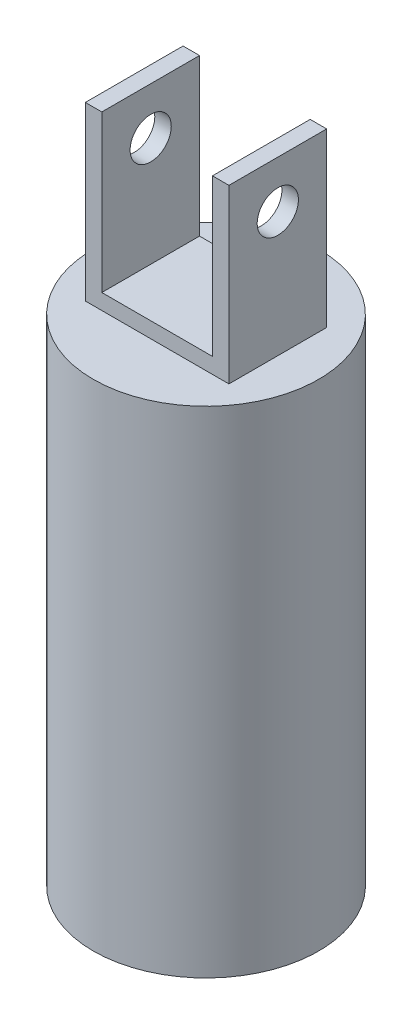
ISO-10303-21;
HEADER;
FILE_DESCRIPTION(('STEP AP214'),'2;1');
FILE_NAME('part.step','',(''),(''),'','','');
FILE_SCHEMA(('AUTOMOTIVE_DESIGN { 1 0 10303 214 1 1 1 1 }'));
ENDSEC;
DATA;
#1=APPLICATION_CONTEXT('core data for automotive mechanical design processes');
#2=APPLICATION_PROTOCOL_DEFINITION('international standard','automotive_design',2000,#1);
#3=PRODUCT_CONTEXT('',#1,'mechanical');
#4=PRODUCT('Part','Part','',(#3));
#5=PRODUCT_RELATED_PRODUCT_CATEGORY('part','',(#4));
#6=PRODUCT_DEFINITION_FORMATION('','',#4);
#7=PRODUCT_DEFINITION_CONTEXT('part definition',#1,'design');
#8=PRODUCT_DEFINITION('design','',#6,#7);
#9=PRODUCT_DEFINITION_SHAPE('','',#8);
#10=(LENGTH_UNIT() NAMED_UNIT(*) SI_UNIT(.MILLI.,.METRE.));
#11=(NAMED_UNIT(*) PLANE_ANGLE_UNIT() SI_UNIT($,.RADIAN.));
#12=(NAMED_UNIT(*) SI_UNIT($,.STERADIAN.) SOLID_ANGLE_UNIT());
#13=UNCERTAINTY_MEASURE_WITH_UNIT(LENGTH_MEASURE(1.E-05),#10,'distance_accuracy_value','');
#14=(GEOMETRIC_REPRESENTATION_CONTEXT(3) GLOBAL_UNCERTAINTY_ASSIGNED_CONTEXT((#13)) GLOBAL_UNIT_ASSIGNED_CONTEXT((#10,
#11,#12)) REPRESENTATION_CONTEXT('',''));
#15=CARTESIAN_POINT('',(0.,0.,0.));
#16=DIRECTION('',(0.,0.,1.));
#17=DIRECTION('',(1.,0.,0.));
#18=AXIS2_PLACEMENT_3D('',#15,#16,#17);
#19=CARTESIAN_POINT('',(0.,50.3809,28.6258));
#20=DIRECTION('',(0.,1.,0.));
#21=DIRECTION('',(0.,0.,1.));
#22=AXIS2_PLACEMENT_3D('',#19,#20,#21);
#23=PLANE('',#22);
#24=DIRECTION('',(1.,0.,0.));
#25=VECTOR('',#24,1.);
#26=CARTESIAN_POINT('',(0.,50.3809,0.));
#27=LINE('',#26,#25);
#28=CARTESIAN_POINT('',(37.2364,50.3809,0.));
#29=VERTEX_POINT('',#28);
#30=CARTESIAN_POINT('',(42.0624,50.3809,0.));
#31=VERTEX_POINT('',#30);
#32=EDGE_CURVE('E147',#29,#31,#27,.T.);
#33=ORIENTED_EDGE('',*,*,#32,.F.);
#34=DIRECTION('',(0.,0.,-1.));
#35=VECTOR('',#34,1.);
#36=CARTESIAN_POINT('',(37.2364,50.3809,28.6258));
#37=LINE('',#36,#35);
#38=CARTESIAN_POINT('',(37.2364,50.3809,28.6258));
#39=VERTEX_POINT('',#38);
#40=EDGE_CURVE('E12',#39,#29,#37,.T.);
#41=ORIENTED_EDGE('',*,*,#40,.F.);
#42=DIRECTION('',(1.,0.,0.));
#43=VECTOR('',#42,1.);
#44=CARTESIAN_POINT('',(0.,50.3809,28.6258));
#45=LINE('',#44,#43);
#46=CARTESIAN_POINT('',(42.0624,50.3809,28.6258));
#47=VERTEX_POINT('',#46);
#48=EDGE_CURVE('E176',#39,#47,#45,.T.);
#49=ORIENTED_EDGE('',*,*,#48,.T.);
#50=DIRECTION('',(0.,0.,-1.));
#51=VECTOR('',#50,1.);
#52=CARTESIAN_POINT('',(42.0624,50.3809,28.6258));
#53=LINE('',#52,#51);
#54=EDGE_CURVE('E100',#47,#31,#53,.T.);
#55=ORIENTED_EDGE('',*,*,#54,.T.);
#56=EDGE_LOOP('',(#33,#41,#49,#55));
#57=FACE_BOUND('',#56,.T.);
#58=ADVANCED_FACE('F49',(#57),#23,.T.);
#59=CARTESIAN_POINT('',(37.2364,0.,28.6258));
#60=DIRECTION('',(-1.,0.,0.));
#61=DIRECTION('',(0.,0.,1.));
#62=AXIS2_PLACEMENT_3D('',#59,#60,#61);
#63=PLANE('',#62);
#64=CARTESIAN_POINT('',(37.2364,36.576,14.3129));
#65=DIRECTION('',(-1.,0.,0.));
#66=DIRECTION('',(0.,0.,1.));
#67=AXIS2_PLACEMENT_3D('',#64,#65,#66);
#68=CIRCLE('',#67,6.0325);
#69=CARTESIAN_POINT('',(37.2364,36.576,20.3454));
#70=VERTEX_POINT('',#69);
#71=EDGE_CURVE('E230',#70,#70,#68,.T.);
#72=ORIENTED_EDGE('',*,*,#71,.F.);
#73=EDGE_LOOP('',(#72));
#74=FACE_BOUND('',#73,.T.);
#75=DIRECTION('',(0.,1.,0.));
#76=VECTOR('',#75,1.);
#77=CARTESIAN_POINT('',(37.2364,0.,0.));
#78=LINE('',#77,#76);
#79=CARTESIAN_POINT('',(37.2364,4.572,0.));
#80=VERTEX_POINT('',#79);
#81=EDGE_CURVE('E151',#80,#29,#78,.T.);
#82=ORIENTED_EDGE('',*,*,#81,.F.);
#83=DIRECTION('',(0.,0.,-1.));
#84=VECTOR('',#83,1.);
#85=CARTESIAN_POINT('',(37.2364,4.572,28.6258));
#86=LINE('',#85,#84);
#87=CARTESIAN_POINT('',(37.2364,4.572,28.6258));
#88=VERTEX_POINT('',#87);
#89=EDGE_CURVE('E58',#88,#80,#86,.T.);
#90=ORIENTED_EDGE('',*,*,#89,.F.);
#91=DIRECTION('',(0.,1.,0.));
#92=VECTOR('',#91,1.);
#93=CARTESIAN_POINT('',(37.2364,0.,28.6258));
#94=LINE('',#93,#92);
#95=EDGE_CURVE('E208',#88,#39,#94,.T.);
#96=ORIENTED_EDGE('',*,*,#95,.T.);
#97=ORIENTED_EDGE('',*,*,#40,.T.);
#98=EDGE_LOOP('',(#82,#90,#96,#97));
#99=FACE_BOUND('',#98,.T.);
#100=ADVANCED_FACE('F199',(#74,#99),#63,.T.);
#101=CARTESIAN_POINT('',(0.,4.572,28.6258));
#102=DIRECTION('',(0.,1.,0.));
#103=DIRECTION('',(0.,0.,1.));
#104=AXIS2_PLACEMENT_3D('',#101,#102,#103);
#105=PLANE('',#104);
#106=DIRECTION('',(1.,0.,0.));
#107=VECTOR('',#106,1.);
#108=CARTESIAN_POINT('',(0.,4.572,0.));
#109=LINE('',#108,#107);
#110=CARTESIAN_POINT('',(4.826,4.572,0.));
#111=VERTEX_POINT('',#110);
#112=EDGE_CURVE('E156',#111,#80,#109,.T.);
#113=ORIENTED_EDGE('',*,*,#112,.F.);
#114=DIRECTION('',(0.,0.,-1.));
#115=VECTOR('',#114,1.);
#116=CARTESIAN_POINT('',(4.826,4.572,28.6258));
#117=LINE('',#116,#115);
#118=CARTESIAN_POINT('',(4.826,4.572,28.6258));
#119=VERTEX_POINT('',#118);
#120=EDGE_CURVE('E186',#119,#111,#117,.T.);
#121=ORIENTED_EDGE('',*,*,#120,.F.);
#122=DIRECTION('',(1.,0.,0.));
#123=VECTOR('',#122,1.);
#124=CARTESIAN_POINT('',(0.,4.572,28.6258));
#125=LINE('',#124,#123);
#126=EDGE_CURVE('E195',#119,#88,#125,.T.);
#127=ORIENTED_EDGE('',*,*,#126,.T.);
#128=ORIENTED_EDGE('',*,*,#89,.T.);
#129=EDGE_LOOP('',(#113,#121,#127,#128));
#130=FACE_BOUND('',#129,.T.);
#131=ADVANCED_FACE('F193',(#130),#105,.T.);
#132=CARTESIAN_POINT('',(4.826,0.,28.6258));
#133=DIRECTION('',(1.,0.,0.));
#134=DIRECTION('',(0.,0.,-1.));
#135=AXIS2_PLACEMENT_3D('',#132,#133,#134);
#136=PLANE('',#135);
#137=CARTESIAN_POINT('',(4.826,36.576,14.3129));
#138=DIRECTION('',(1.,0.,0.));
#139=DIRECTION('',(0.,0.,-1.));
#140=AXIS2_PLACEMENT_3D('',#137,#138,#139);
#141=CIRCLE('',#140,6.0325);
#142=CARTESIAN_POINT('',(4.826,36.576,8.2804));
#143=VERTEX_POINT('',#142);
#144=EDGE_CURVE('E234',#143,#143,#141,.T.);
#145=ORIENTED_EDGE('',*,*,#144,.F.);
#146=EDGE_LOOP('',(#145));
#147=FACE_BOUND('',#146,.T.);
#148=DIRECTION('',(0.,-1.,0.));
#149=VECTOR('',#148,1.);
#150=CARTESIAN_POINT('',(4.826,0.,0.));
#151=LINE('',#150,#149);
#152=CARTESIAN_POINT('',(4.826,50.3809,0.));
#153=VERTEX_POINT('',#152);
#154=EDGE_CURVE('E160',#153,#111,#151,.T.);
#155=ORIENTED_EDGE('',*,*,#154,.F.);
#156=DIRECTION('',(0.,0.,-1.));
#157=VECTOR('',#156,1.);
#158=CARTESIAN_POINT('',(4.826,50.3809,28.6258));
#159=LINE('',#158,#157);
#160=CARTESIAN_POINT('',(4.826,50.3809,28.6258));
#161=VERTEX_POINT('',#160);
#162=EDGE_CURVE('E183',#161,#153,#159,.T.);
#163=ORIENTED_EDGE('',*,*,#162,.F.);
#164=DIRECTION('',(0.,-1.,0.));
#165=VECTOR('',#164,1.);
#166=CARTESIAN_POINT('',(4.826,0.,28.6258));
#167=LINE('',#166,#165);
#168=EDGE_CURVE('E207',#161,#119,#167,.T.);
#169=ORIENTED_EDGE('',*,*,#168,.T.);
#170=ORIENTED_EDGE('',*,*,#120,.T.);
#171=EDGE_LOOP('',(#155,#163,#169,#170));
#172=FACE_BOUND('',#171,.T.);
#173=ADVANCED_FACE('F205',(#147,#172),#136,.T.);
#174=CARTESIAN_POINT('',(0.,50.3809,28.6258));
#175=DIRECTION('',(0.,1.,0.));
#176=DIRECTION('',(0.,0.,1.));
#177=AXIS2_PLACEMENT_3D('',#174,#175,#176);
#178=PLANE('',#177);
#179=DIRECTION('',(1.,0.,0.));
#180=VECTOR('',#179,1.);
#181=CARTESIAN_POINT('',(0.,50.3809,0.));
#182=LINE('',#181,#180);
#183=CARTESIAN_POINT('',(0.,50.3809,0.));
#184=VERTEX_POINT('',#183);
#185=EDGE_CURVE('E164',#184,#153,#182,.T.);
#186=ORIENTED_EDGE('',*,*,#185,.F.);
#187=DIRECTION('',(0.,0.,-1.));
#188=VECTOR('',#187,1.);
#189=CARTESIAN_POINT('',(0.,50.3809,28.6258));
#190=LINE('',#189,#188);
#191=CARTESIAN_POINT('',(0.,50.3809,28.6258));
#192=VERTEX_POINT('',#191);
#193=EDGE_CURVE('E129',#192,#184,#190,.T.);
#194=ORIENTED_EDGE('',*,*,#193,.F.);
#195=DIRECTION('',(1.,0.,0.));
#196=VECTOR('',#195,1.);
#197=CARTESIAN_POINT('',(0.,50.3809,28.6258));
#198=LINE('',#197,#196);
#199=EDGE_CURVE('E136',#192,#161,#198,.T.);
#200=ORIENTED_EDGE('',*,*,#199,.T.);
#201=ORIENTED_EDGE('',*,*,#162,.T.);
#202=EDGE_LOOP('',(#186,#194,#200,#201));
#203=FACE_BOUND('',#202,.T.);
#204=ADVANCED_FACE('F218',(#203),#178,.T.);
#205=CARTESIAN_POINT('',(0.,0.,28.6258));
#206=DIRECTION('',(-1.,0.,0.));
#207=DIRECTION('',(0.,0.,1.));
#208=AXIS2_PLACEMENT_3D('',#205,#206,#207);
#209=PLANE('',#208);
#210=CARTESIAN_POINT('',(0.,36.576,14.3129));
#211=DIRECTION('',(-1.,0.,0.));
#212=DIRECTION('',(0.,0.,1.));
#213=AXIS2_PLACEMENT_3D('',#210,#211,#212);
#214=CIRCLE('',#213,6.0325);
#215=CARTESIAN_POINT('',(0.,36.576,20.3454));
#216=VERTEX_POINT('',#215);
#217=EDGE_CURVE('E238',#216,#216,#214,.T.);
#218=ORIENTED_EDGE('',*,*,#217,.F.);
#219=EDGE_LOOP('',(#218));
#220=FACE_BOUND('',#219,.T.);
#221=DIRECTION('',(0.,1.,0.));
#222=VECTOR('',#221,1.);
#223=CARTESIAN_POINT('',(0.,0.,0.));
#224=LINE('',#223,#222);
#225=CARTESIAN_POINT('',(0.,0.,0.));
#226=VERTEX_POINT('',#225);
#227=EDGE_CURVE('E124',#226,#184,#224,.T.);
#228=ORIENTED_EDGE('',*,*,#227,.F.);
#229=DIRECTION('',(0.,0.,-1.));
#230=VECTOR('',#229,1.);
#231=CARTESIAN_POINT('',(0.,0.,28.6258));
#232=LINE('',#231,#230);
#233=CARTESIAN_POINT('',(0.,0.,28.6258));
#234=VERTEX_POINT('',#233);
#235=EDGE_CURVE('E119',#234,#226,#232,.T.);
#236=ORIENTED_EDGE('',*,*,#235,.F.);
#237=DIRECTION('',(0.,1.,0.));
#238=VECTOR('',#237,1.);
#239=CARTESIAN_POINT('',(0.,0.,28.6258));
#240=LINE('',#239,#238);
#241=EDGE_CURVE('E122',#234,#192,#240,.T.);
#242=ORIENTED_EDGE('',*,*,#241,.T.);
#243=ORIENTED_EDGE('',*,*,#193,.T.);
#244=EDGE_LOOP('',(#228,#236,#242,#243));
#245=FACE_BOUND('',#244,.T.);
#246=ADVANCED_FACE('F121',(#220,#245),#209,.T.);
#247=CARTESIAN_POINT('',(42.0624,0.,28.6258));
#248=DIRECTION('',(-1.,0.,0.));
#249=DIRECTION('',(0.,0.,1.));
#250=AXIS2_PLACEMENT_3D('',#247,#248,#249);
#251=PLANE('',#250);
#252=CARTESIAN_POINT('',(42.0624,36.576,14.3129));
#253=DIRECTION('',(1.,0.,0.));
#254=DIRECTION('',(0.,0.,-1.));
#255=AXIS2_PLACEMENT_3D('',#252,#253,#254);
#256=CIRCLE('',#255,6.0325);
#257=CARTESIAN_POINT('',(42.0624,36.576,8.2804));
#258=VERTEX_POINT('',#257);
#259=EDGE_CURVE('E242',#258,#258,#256,.T.);
#260=ORIENTED_EDGE('',*,*,#259,.F.);
#261=EDGE_LOOP('',(#260));
#262=FACE_BOUND('',#261,.T.);
#263=DIRECTION('',(0.,1.,0.));
#264=VECTOR('',#263,1.);
#265=CARTESIAN_POINT('',(42.0624,0.,0.));
#266=LINE('',#265,#264);
#267=CARTESIAN_POINT('',(42.0624,0.,0.));
#268=VERTEX_POINT('',#267);
#269=EDGE_CURVE('E173',#268,#31,#266,.T.);
#270=ORIENTED_EDGE('',*,*,#269,.T.);
#271=ORIENTED_EDGE('',*,*,#54,.F.);
#272=DIRECTION('',(0.,1.,0.));
#273=VECTOR('',#272,1.);
#274=CARTESIAN_POINT('',(42.0624,0.,28.6258));
#275=LINE('',#274,#273);
#276=CARTESIAN_POINT('',(42.0624,0.,28.6258));
#277=VERTEX_POINT('',#276);
#278=EDGE_CURVE('E66',#277,#47,#275,.T.);
#279=ORIENTED_EDGE('',*,*,#278,.F.);
#280=DIRECTION('',(0.,0.,-1.));
#281=VECTOR('',#280,1.);
#282=CARTESIAN_POINT('',(42.0624,0.,28.6258));
#283=LINE('',#282,#281);
#284=EDGE_CURVE('E93',#277,#268,#283,.T.);
#285=ORIENTED_EDGE('',*,*,#284,.T.);
#286=EDGE_LOOP('',(#270,#271,#279,#285));
#287=FACE_BOUND('',#286,.T.);
#288=ADVANCED_FACE('F220',(#262,#287),#251,.F.);
#289=CARTESIAN_POINT('',(0.,0.,28.6258));
#290=DIRECTION('',(0.,0.,1.));
#291=DIRECTION('',(1.,0.,0.));
#292=AXIS2_PLACEMENT_3D('',#289,#290,#291);
#293=PLANE('',#292);
#294=ORIENTED_EDGE('',*,*,#48,.F.);
#295=ORIENTED_EDGE('',*,*,#95,.F.);
#296=ORIENTED_EDGE('',*,*,#126,.F.);
#297=ORIENTED_EDGE('',*,*,#168,.F.);
#298=ORIENTED_EDGE('',*,*,#199,.F.);
#299=ORIENTED_EDGE('',*,*,#241,.F.);
#300=DIRECTION('',(1.,0.,0.));
#301=VECTOR('',#300,1.);
#302=CARTESIAN_POINT('',(0.,0.,28.6258));
#303=LINE('',#302,#301);
#304=EDGE_CURVE('E133',#234,#277,#303,.T.);
#305=ORIENTED_EDGE('',*,*,#304,.T.);
#306=ORIENTED_EDGE('',*,*,#278,.T.);
#307=EDGE_LOOP('',(#294,#295,#296,#297,#298,#299,#305,#306));
#308=FACE_BOUND('',#307,.T.);
#309=ADVANCED_FACE('F132',(#308),#293,.T.);
#310=CARTESIAN_POINT('',(0.,0.,0.));
#311=DIRECTION('',(0.,0.,1.));
#312=DIRECTION('',(1.,0.,0.));
#313=AXIS2_PLACEMENT_3D('',#310,#311,#312);
#314=PLANE('',#313);
#315=ORIENTED_EDGE('',*,*,#32,.T.);
#316=ORIENTED_EDGE('',*,*,#269,.F.);
#317=DIRECTION('',(1.,0.,0.));
#318=VECTOR('',#317,1.);
#319=CARTESIAN_POINT('',(0.,0.,0.));
#320=LINE('',#319,#318);
#321=EDGE_CURVE('E170',#226,#268,#320,.T.);
#322=ORIENTED_EDGE('',*,*,#321,.F.);
#323=ORIENTED_EDGE('',*,*,#227,.T.);
#324=ORIENTED_EDGE('',*,*,#185,.T.);
#325=ORIENTED_EDGE('',*,*,#154,.T.);
#326=ORIENTED_EDGE('',*,*,#112,.T.);
#327=ORIENTED_EDGE('',*,*,#81,.T.);
#328=EDGE_LOOP('',(#315,#316,#322,#323,#324,#325,#326,#327));
#329=FACE_BOUND('',#328,.T.);
#330=ADVANCED_FACE('F201',(#329),#314,.F.);
#331=CARTESIAN_POINT('',(21.0312,0.,14.3129));
#332=DIRECTION('',(0.,-1.,0.));
#333=DIRECTION('',(0.,0.,-1.));
#334=AXIS2_PLACEMENT_3D('',#331,#332,#333);
#335=PLANE('',#334);
#336=ORIENTED_EDGE('',*,*,#321,.T.);
#337=ORIENTED_EDGE('',*,*,#284,.F.);
#338=ORIENTED_EDGE('',*,*,#304,.F.);
#339=ORIENTED_EDGE('',*,*,#235,.T.);
#340=EDGE_LOOP('',(#336,#337,#338,#339));
#341=FACE_BOUND('',#340,.T.);
#342=CARTESIAN_POINT('',(21.0312,0.,14.3129));
#343=DIRECTION('',(0.,1.,0.));
#344=DIRECTION('',(0.,0.,1.));
#345=AXIS2_PLACEMENT_3D('',#342,#343,#344);
#346=CIRCLE('',#345,33.02);
#347=CARTESIAN_POINT('',(21.0312,0.,47.3329));
#348=VERTEX_POINT('',#347);
#349=EDGE_CURVE('E226',#348,#348,#346,.T.);
#350=ORIENTED_EDGE('',*,*,#349,.T.);
#351=EDGE_LOOP('',(#350));
#352=FACE_BOUND('',#351,.T.);
#353=ADVANCED_FACE('F139',(#341,#352),#335,.F.);
#354=CARTESIAN_POINT('',(21.0312,-238.428663659119,14.3129));
#355=DIRECTION('',(0.,1.,0.));
#356=DIRECTION('',(0.,0.,1.));
#357=AXIS2_PLACEMENT_3D('',#354,#355,#356);
#358=CYLINDRICAL_SURFACE('',#357,33.02);
#359=ORIENTED_EDGE('',*,*,#349,.F.);
#360=EDGE_LOOP('',(#359));
#361=FACE_BOUND('',#360,.T.);
#362=CARTESIAN_POINT('',(21.0312,-145.034,14.3129));
#363=DIRECTION('',(0.,-1.,0.));
#364=DIRECTION('',(0.,0.,-1.));
#365=AXIS2_PLACEMENT_3D('',#362,#363,#364);
#366=CIRCLE('',#365,33.02);
#367=CARTESIAN_POINT('',(21.0312,-145.034,-18.7071));
#368=VERTEX_POINT('',#367);
#369=EDGE_CURVE('E152',#368,#368,#366,.F.);
#370=ORIENTED_EDGE('',*,*,#369,.T.);
#371=EDGE_LOOP('',(#370));
#372=FACE_BOUND('',#371,.T.);
#373=ADVANCED_FACE('F268',(#361,#372),#358,.T.);
#374=CARTESIAN_POINT('',(21.0312,-145.034,14.3129));
#375=DIRECTION('',(0.,-1.,0.));
#376=DIRECTION('',(0.,0.,-1.));
#377=AXIS2_PLACEMENT_3D('',#374,#375,#376);
#378=PLANE('',#377);
#379=CARTESIAN_POINT('',(21.0312,-145.034,14.3129));
#380=DIRECTION('',(0.,-1.,0.));
#381=DIRECTION('',(0.,0.,-1.));
#382=AXIS2_PLACEMENT_3D('',#379,#380,#381);
#383=CIRCLE('',#382,19.812);
#384=CARTESIAN_POINT('',(21.0312,-145.034,-5.4991));
#385=VERTEX_POINT('',#384);
#386=EDGE_CURVE('E247',#385,#385,#383,.T.);
#387=ORIENTED_EDGE('',*,*,#386,.F.);
#388=EDGE_LOOP('',(#387));
#389=FACE_BOUND('',#388,.T.);
#390=ORIENTED_EDGE('',*,*,#369,.F.);
#391=EDGE_LOOP('',(#390));
#392=FACE_BOUND('',#391,.T.);
#393=ADVANCED_FACE('F264',(#389,#392),#378,.T.);
#394=CARTESIAN_POINT('',(-11.9888,36.576,14.3129));
#395=DIRECTION('',(1.,0.,0.));
#396=DIRECTION('',(0.,0.,-1.));
#397=AXIS2_PLACEMENT_3D('',#394,#395,#396);
#398=CYLINDRICAL_SURFACE('',#397,6.0325);
#399=ORIENTED_EDGE('',*,*,#71,.T.);
#400=EDGE_LOOP('',(#399));
#401=FACE_BOUND('',#400,.T.);
#402=ORIENTED_EDGE('',*,*,#259,.T.);
#403=EDGE_LOOP('',(#402));
#404=FACE_BOUND('',#403,.T.);
#405=ADVANCED_FACE('F267',(#401,#404),#398,.F.);
#406=ORIENTED_EDGE('',*,*,#144,.T.);
#407=EDGE_LOOP('',(#406));
#408=FACE_BOUND('',#407,.T.);
#409=ORIENTED_EDGE('',*,*,#217,.T.);
#410=EDGE_LOOP('',(#409));
#411=FACE_BOUND('',#410,.T.);
#412=ADVANCED_FACE('F260',(#408,#411),#398,.F.);
#413=CARTESIAN_POINT('',(21.0312,-38.1,14.3129));
#414=DIRECTION('',(0.,-1.,0.));
#415=DIRECTION('',(0.,0.,-1.));
#416=AXIS2_PLACEMENT_3D('',#413,#414,#415);
#417=CYLINDRICAL_SURFACE('',#416,19.812);
#418=CARTESIAN_POINT('',(21.0312,-38.1,14.3129));
#419=DIRECTION('',(0.,-1.,0.));
#420=DIRECTION('',(0.,0.,-1.));
#421=AXIS2_PLACEMENT_3D('',#418,#419,#420);
#422=CIRCLE('',#421,19.812);
#423=CARTESIAN_POINT('',(21.0312,-38.1,-5.4991));
#424=VERTEX_POINT('',#423);
#425=EDGE_CURVE('E246',#424,#424,#422,.T.);
#426=ORIENTED_EDGE('',*,*,#425,.F.);
#427=EDGE_LOOP('',(#426));
#428=FACE_BOUND('',#427,.T.);
#429=ORIENTED_EDGE('',*,*,#386,.T.);
#430=EDGE_LOOP('',(#429));
#431=FACE_BOUND('',#430,.T.);
#432=ADVANCED_FACE('F257',(#428,#431),#417,.F.);
#433=CARTESIAN_POINT('',(21.0312,-38.1,14.3129));
#434=DIRECTION('',(0.,-1.,0.));
#435=DIRECTION('',(0.,0.,-1.));
#436=AXIS2_PLACEMENT_3D('',#433,#434,#435);
#437=PLANE('',#436);
#438=ORIENTED_EDGE('',*,*,#425,.T.);
#439=EDGE_LOOP('',(#438));
#440=FACE_BOUND('',#439,.T.);
#441=ADVANCED_FACE('F255',(#440),#437,.T.);
#442=CLOSED_SHELL('',(#58,#100,#131,#173,#204,#246,#288,#309,#330,#353,#373,#393,#405,#412,#432,#441));
#443=MANIFOLD_SOLID_BREP('B2',#442);
#444=ADVANCED_BREP_SHAPE_REPRESENTATION('',(#18,#443),#14);
#445=SHAPE_DEFINITION_REPRESENTATION(#9,#444);
ENDSEC;
END-ISO-10303-21;
